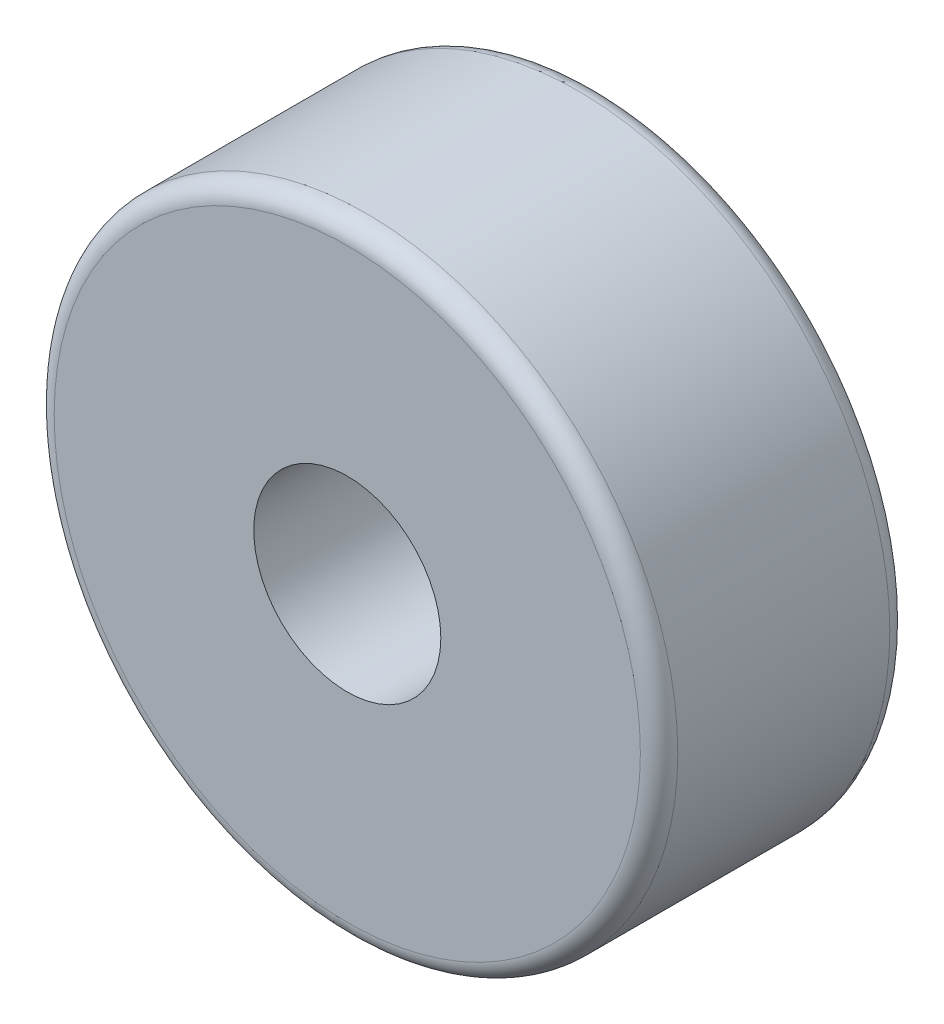
ISO-10303-21;
HEADER;
FILE_DESCRIPTION(('STEP AP214'),'2;1');
FILE_NAME('part.step','',(''),(''),'','','');
FILE_SCHEMA(('AUTOMOTIVE_DESIGN { 1 0 10303 214 1 1 1 1 }'));
ENDSEC;
DATA;
#1=APPLICATION_CONTEXT('core data for automotive mechanical design processes');
#2=APPLICATION_PROTOCOL_DEFINITION('international standard','automotive_design',2000,#1);
#3=PRODUCT_CONTEXT('',#1,'mechanical');
#4=PRODUCT('Part','Part','',(#3));
#5=PRODUCT_RELATED_PRODUCT_CATEGORY('part','',(#4));
#6=PRODUCT_DEFINITION_FORMATION('','',#4);
#7=PRODUCT_DEFINITION_CONTEXT('part definition',#1,'design');
#8=PRODUCT_DEFINITION('design','',#6,#7);
#9=PRODUCT_DEFINITION_SHAPE('','',#8);
#10=(LENGTH_UNIT() NAMED_UNIT(*) SI_UNIT(.MILLI.,.METRE.));
#11=(NAMED_UNIT(*) PLANE_ANGLE_UNIT() SI_UNIT($,.RADIAN.));
#12=(NAMED_UNIT(*) SI_UNIT($,.STERADIAN.) SOLID_ANGLE_UNIT());
#13=UNCERTAINTY_MEASURE_WITH_UNIT(LENGTH_MEASURE(1.E-05),#10,'distance_accuracy_value','');
#14=(GEOMETRIC_REPRESENTATION_CONTEXT(3) GLOBAL_UNCERTAINTY_ASSIGNED_CONTEXT((#13)) GLOBAL_UNIT_ASSIGNED_CONTEXT((#10,
#11,#12)) REPRESENTATION_CONTEXT('',''));
#15=CARTESIAN_POINT('',(0.,0.,0.));
#16=DIRECTION('',(0.,0.,1.));
#17=DIRECTION('',(1.,0.,0.));
#18=AXIS2_PLACEMENT_3D('',#15,#16,#17);
#19=CARTESIAN_POINT('',(0.,0.,4.));
#20=DIRECTION('',(0.,0.,1.));
#21=DIRECTION('',(1.,0.,0.));
#22=AXIS2_PLACEMENT_3D('',#19,#20,#21);
#23=PLANE('',#22);
#24=CARTESIAN_POINT('',(0.,0.,4.));
#25=DIRECTION('',(0.,0.,1.));
#26=DIRECTION('',(1.,0.,0.));
#27=AXIS2_PLACEMENT_3D('',#24,#25,#26);
#28=CIRCLE('',#27,4.7);
#29=CARTESIAN_POINT('',(4.7,0.,4.));
#30=VERTEX_POINT('',#29);
#31=EDGE_CURVE('E10',#30,#30,#28,.T.);
#32=ORIENTED_EDGE('',*,*,#31,.T.);
#33=EDGE_LOOP('',(#32));
#34=FACE_BOUND('',#33,.T.);
#35=CARTESIAN_POINT('',(0.,0.,4.));
#36=DIRECTION('',(0.,0.,1.));
#37=DIRECTION('',(1.,0.,0.));
#38=AXIS2_PLACEMENT_3D('',#35,#36,#37);
#39=CIRCLE('',#38,1.5);
#40=CARTESIAN_POINT('',(1.5,0.,4.));
#41=VERTEX_POINT('',#40);
#42=EDGE_CURVE('E61',#41,#41,#39,.T.);
#43=ORIENTED_EDGE('',*,*,#42,.F.);
#44=EDGE_LOOP('',(#43));
#45=FACE_BOUND('',#44,.T.);
#46=ADVANCED_FACE('F37',(#34,#45),#23,.T.);
#47=CARTESIAN_POINT('',(0.,0.,0.));
#48=DIRECTION('',(0.,0.,1.));
#49=DIRECTION('',(1.,0.,0.));
#50=AXIS2_PLACEMENT_3D('',#47,#48,#49);
#51=PLANE('',#50);
#52=CARTESIAN_POINT('',(0.,0.,0.));
#53=DIRECTION('',(0.,0.,1.));
#54=DIRECTION('',(1.,0.,0.));
#55=AXIS2_PLACEMENT_3D('',#52,#53,#54);
#56=CIRCLE('',#55,4.7);
#57=CARTESIAN_POINT('',(4.7,0.,0.));
#58=VERTEX_POINT('',#57);
#59=EDGE_CURVE('E45',#58,#58,#56,.F.);
#60=ORIENTED_EDGE('',*,*,#59,.T.);
#61=EDGE_LOOP('',(#60));
#62=FACE_BOUND('',#61,.T.);
#63=CARTESIAN_POINT('',(0.,0.,0.));
#64=DIRECTION('',(0.,0.,1.));
#65=DIRECTION('',(1.,0.,0.));
#66=AXIS2_PLACEMENT_3D('',#63,#64,#65);
#67=CIRCLE('',#66,1.5);
#68=CARTESIAN_POINT('',(1.5,0.,0.));
#69=VERTEX_POINT('',#68);
#70=EDGE_CURVE('E62',#69,#69,#67,.T.);
#71=ORIENTED_EDGE('',*,*,#70,.T.);
#72=EDGE_LOOP('',(#71));
#73=FACE_BOUND('',#72,.T.);
#74=ADVANCED_FACE('F74',(#62,#73),#51,.F.);
#75=CARTESIAN_POINT('',(0.,0.,4.));
#76=DIRECTION('',(0.,0.,-1.));
#77=DIRECTION('',(-1.,0.,0.));
#78=AXIS2_PLACEMENT_3D('',#75,#76,#77);
#79=CYLINDRICAL_SURFACE('',#78,5.);
#80=CARTESIAN_POINT('',(0.,0.,0.3));
#81=DIRECTION('',(0.,0.,1.));
#82=DIRECTION('',(1.,0.,0.));
#83=AXIS2_PLACEMENT_3D('',#80,#81,#82);
#84=CIRCLE('',#83,5.);
#85=CARTESIAN_POINT('',(5.,0.,0.3));
#86=VERTEX_POINT('',#85);
#87=EDGE_CURVE('E50',#86,#86,#84,.T.);
#88=ORIENTED_EDGE('',*,*,#87,.T.);
#89=EDGE_LOOP('',(#88));
#90=FACE_BOUND('',#89,.T.);
#91=CARTESIAN_POINT('',(0.,0.,3.7));
#92=DIRECTION('',(0.,0.,1.));
#93=DIRECTION('',(1.,0.,0.));
#94=AXIS2_PLACEMENT_3D('',#91,#92,#93);
#95=CIRCLE('',#94,5.);
#96=CARTESIAN_POINT('',(5.,0.,3.7));
#97=VERTEX_POINT('',#96);
#98=EDGE_CURVE('E55',#97,#97,#95,.F.);
#99=ORIENTED_EDGE('',*,*,#98,.T.);
#100=EDGE_LOOP('',(#99));
#101=FACE_BOUND('',#100,.T.);
#102=ADVANCED_FACE('F79',(#90,#101),#79,.T.);
#103=CARTESIAN_POINT('',(0.,0.,4.));
#104=DIRECTION('',(0.,0.,-1.));
#105=DIRECTION('',(-1.,0.,0.));
#106=AXIS2_PLACEMENT_3D('',#103,#104,#105);
#107=CYLINDRICAL_SURFACE('',#106,1.5);
#108=ORIENTED_EDGE('',*,*,#42,.T.);
#109=EDGE_LOOP('',(#108));
#110=FACE_BOUND('',#109,.T.);
#111=ORIENTED_EDGE('',*,*,#70,.F.);
#112=EDGE_LOOP('',(#111));
#113=FACE_BOUND('',#112,.T.);
#114=ADVANCED_FACE('F70',(#110,#113),#107,.F.);
#115=CARTESIAN_POINT('',(0.,0.,0.3));
#116=DIRECTION('',(0.,0.,1.));
#117=DIRECTION('',(1.,0.,0.));
#118=AXIS2_PLACEMENT_3D('',#115,#116,#117);
#119=TOROIDAL_SURFACE('',#118,4.7,0.3);
#120=ORIENTED_EDGE('',*,*,#59,.F.);
#121=EDGE_LOOP('',(#120));
#122=FACE_BOUND('',#121,.T.);
#123=ORIENTED_EDGE('',*,*,#87,.F.);
#124=EDGE_LOOP('',(#123));
#125=FACE_BOUND('',#124,.T.);
#126=ADVANCED_FACE('F85',(#122,#125),#119,.T.);
#127=CARTESIAN_POINT('',(0.,0.,3.7));
#128=DIRECTION('',(0.,0.,1.));
#129=DIRECTION('',(1.,0.,0.));
#130=AXIS2_PLACEMENT_3D('',#127,#128,#129);
#131=TOROIDAL_SURFACE('',#130,4.7,0.3);
#132=ORIENTED_EDGE('',*,*,#98,.F.);
#133=EDGE_LOOP('',(#132));
#134=FACE_BOUND('',#133,.T.);
#135=ORIENTED_EDGE('',*,*,#31,.F.);
#136=EDGE_LOOP('',(#135));
#137=FACE_BOUND('',#136,.T.);
#138=ADVANCED_FACE('F39',(#134,#137),#131,.T.);
#139=CLOSED_SHELL('',(#46,#74,#102,#114,#126,#138));
#140=MANIFOLD_SOLID_BREP('B2',#139);
#141=ADVANCED_BREP_SHAPE_REPRESENTATION('',(#18,#140),#14);
#142=SHAPE_DEFINITION_REPRESENTATION(#9,#141);
ENDSEC;
END-ISO-10303-21;
